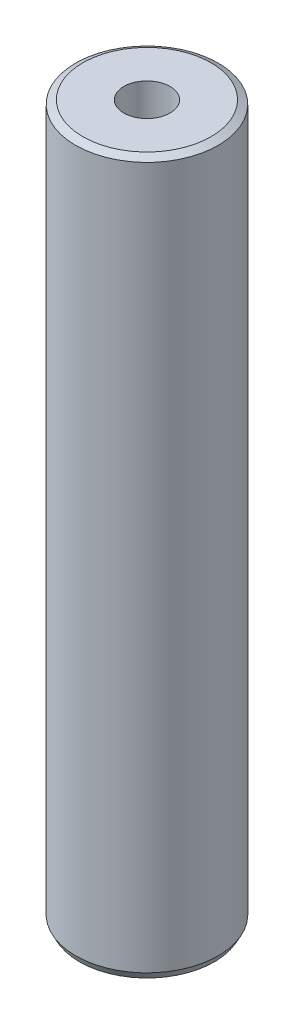
ISO-10303-21;
HEADER;
FILE_DESCRIPTION(('STEP AP214'),'2;1');
FILE_NAME('part.step','',(''),(''),'','','');
FILE_SCHEMA(('AUTOMOTIVE_DESIGN { 1 0 10303 214 1 1 1 1 }'));
ENDSEC;
DATA;
#1=APPLICATION_CONTEXT('core data for automotive mechanical design processes');
#2=APPLICATION_PROTOCOL_DEFINITION('international standard','automotive_design',2000,#1);
#3=PRODUCT_CONTEXT('',#1,'mechanical');
#4=PRODUCT('Part','Part','',(#3));
#5=PRODUCT_RELATED_PRODUCT_CATEGORY('part','',(#4));
#6=PRODUCT_DEFINITION_FORMATION('','',#4);
#7=PRODUCT_DEFINITION_CONTEXT('part definition',#1,'design');
#8=PRODUCT_DEFINITION('design','',#6,#7);
#9=PRODUCT_DEFINITION_SHAPE('','',#8);
#10=(LENGTH_UNIT() NAMED_UNIT(*) SI_UNIT(.MILLI.,.METRE.));
#11=(NAMED_UNIT(*) PLANE_ANGLE_UNIT() SI_UNIT($,.RADIAN.));
#12=(NAMED_UNIT(*) SI_UNIT($,.STERADIAN.) SOLID_ANGLE_UNIT());
#13=UNCERTAINTY_MEASURE_WITH_UNIT(LENGTH_MEASURE(1.E-05),#10,'distance_accuracy_value','');
#14=(GEOMETRIC_REPRESENTATION_CONTEXT(3) GLOBAL_UNCERTAINTY_ASSIGNED_CONTEXT((#13)) GLOBAL_UNIT_ASSIGNED_CONTEXT((#10,
#11,#12)) REPRESENTATION_CONTEXT('',''));
#15=CARTESIAN_POINT('',(0.,0.,0.));
#16=DIRECTION('',(0.,0.,1.));
#17=DIRECTION('',(1.,0.,0.));
#18=AXIS2_PLACEMENT_3D('',#15,#16,#17);
#19=CARTESIAN_POINT('',(0.,600.,0.));
#20=DIRECTION('',(0.,-1.,0.));
#21=DIRECTION('',(0.,0.,-1.));
#22=AXIS2_PLACEMENT_3D('',#19,#20,#21);
#23=CYLINDRICAL_SURFACE('',#22,60.);
#24=CARTESIAN_POINT('',(0.,596.731679178508,0.));
#25=DIRECTION('',(0.,1.,0.));
#26=DIRECTION('',(0.,0.,1.));
#27=AXIS2_PLACEMENT_3D('',#24,#25,#26);
#28=CIRCLE('',#27,60.);
#29=CARTESIAN_POINT('',(0.,596.731679178508,60.));
#30=VERTEX_POINT('',#29);
#31=EDGE_CURVE('E50',#30,#30,#28,.F.);
#32=ORIENTED_EDGE('',*,*,#31,.T.);
#33=EDGE_LOOP('',(#32));
#34=FACE_BOUND('',#33,.T.);
#35=CARTESIAN_POINT('',(0.,6.07572762020392,0.));
#36=DIRECTION('',(0.,1.,0.));
#37=DIRECTION('',(0.,0.,1.));
#38=AXIS2_PLACEMENT_3D('',#35,#36,#37);
#39=CIRCLE('',#38,60.);
#40=CARTESIAN_POINT('',(0.,6.07572762020392,60.));
#41=VERTEX_POINT('',#40);
#42=EDGE_CURVE('E51',#41,#41,#39,.T.);
#43=ORIENTED_EDGE('',*,*,#42,.T.);
#44=EDGE_LOOP('',(#43));
#45=FACE_BOUND('',#44,.T.);
#46=ADVANCED_FACE('F39',(#34,#45),#23,.T.);
#47=CARTESIAN_POINT('',(0.,600.,0.));
#48=DIRECTION('',(0.,1.,0.));
#49=DIRECTION('',(0.,0.,1.));
#50=AXIS2_PLACEMENT_3D('',#47,#48,#49);
#51=PLANE('',#50);
#52=CARTESIAN_POINT('',(0.,600.,0.));
#53=DIRECTION('',(0.,1.,0.));
#54=DIRECTION('',(0.,0.,1.));
#55=AXIS2_PLACEMENT_3D('',#52,#53,#54);
#56=CIRCLE('',#55,53.9242723797959);
#57=CARTESIAN_POINT('',(0.,600.,53.9242723797959));
#58=VERTEX_POINT('',#57);
#59=EDGE_CURVE('E54',#58,#58,#56,.T.);
#60=ORIENTED_EDGE('',*,*,#59,.T.);
#61=EDGE_LOOP('',(#60));
#62=FACE_BOUND('',#61,.T.);
#63=CARTESIAN_POINT('',(0.,600.,0.));
#64=DIRECTION('',(0.,1.,0.));
#65=DIRECTION('',(0.,0.,1.));
#66=AXIS2_PLACEMENT_3D('',#63,#64,#65);
#67=CIRCLE('',#66,19.4288408507613);
#68=CARTESIAN_POINT('',(0.,600.,19.4288408507613));
#69=VERTEX_POINT('',#68);
#70=EDGE_CURVE('E58',#69,#69,#67,.T.);
#71=ORIENTED_EDGE('',*,*,#70,.F.);
#72=EDGE_LOOP('',(#71));
#73=FACE_BOUND('',#72,.T.);
#74=ADVANCED_FACE('F69',(#62,#73),#51,.T.);
#75=CARTESIAN_POINT('',(0.,0.,0.));
#76=DIRECTION('',(0.,1.,0.));
#77=DIRECTION('',(0.,0.,1.));
#78=AXIS2_PLACEMENT_3D('',#75,#76,#77);
#79=PLANE('',#78);
#80=CARTESIAN_POINT('',(0.,0.,0.));
#81=DIRECTION('',(0.,1.,0.));
#82=DIRECTION('',(0.,0.,1.));
#83=AXIS2_PLACEMENT_3D('',#80,#81,#82);
#84=CIRCLE('',#83,56.7316791785077);
#85=CARTESIAN_POINT('',(0.,0.,56.7316791785077));
#86=VERTEX_POINT('',#85);
#87=EDGE_CURVE('E10',#86,#86,#84,.F.);
#88=ORIENTED_EDGE('',*,*,#87,.T.);
#89=EDGE_LOOP('',(#88));
#90=FACE_BOUND('',#89,.T.);
#91=CARTESIAN_POINT('',(0.,0.,0.));
#92=DIRECTION('',(0.,1.,0.));
#93=DIRECTION('',(0.,0.,1.));
#94=AXIS2_PLACEMENT_3D('',#91,#92,#93);
#95=CIRCLE('',#94,19.4288408507613);
#96=CARTESIAN_POINT('',(0.,0.,19.4288408507613));
#97=VERTEX_POINT('',#96);
#98=EDGE_CURVE('E63',#97,#97,#95,.T.);
#99=ORIENTED_EDGE('',*,*,#98,.T.);
#100=EDGE_LOOP('',(#99));
#101=FACE_BOUND('',#100,.T.);
#102=ADVANCED_FACE('F75',(#90,#101),#79,.F.);
#103=CARTESIAN_POINT('',(0.,600.,0.));
#104=DIRECTION('',(0.,-1.,0.));
#105=DIRECTION('',(0.,0.,-1.));
#106=AXIS2_PLACEMENT_3D('',#103,#104,#105);
#107=CYLINDRICAL_SURFACE('',#106,19.4288408507613);
#108=ORIENTED_EDGE('',*,*,#70,.T.);
#109=EDGE_LOOP('',(#108));
#110=FACE_BOUND('',#109,.T.);
#111=ORIENTED_EDGE('',*,*,#98,.F.);
#112=EDGE_LOOP('',(#111));
#113=FACE_BOUND('',#112,.T.);
#114=ADVANCED_FACE('F70',(#110,#113),#107,.F.);
#115=CARTESIAN_POINT('',(0.,600.,0.));
#116=DIRECTION('',(0.,-1.,0.));
#117=DIRECTION('',(0.,0.,-1.));
#118=AXIS2_PLACEMENT_3D('',#115,#116,#117);
#119=CONICAL_SURFACE('',#118,53.9242723797959,1.07726651831578);
#120=ORIENTED_EDGE('',*,*,#31,.F.);
#121=EDGE_LOOP('',(#120));
#122=FACE_BOUND('',#121,.T.);
#123=ORIENTED_EDGE('',*,*,#59,.F.);
#124=EDGE_LOOP('',(#123));
#125=FACE_BOUND('',#124,.T.);
#126=ADVANCED_FACE('F81',(#122,#125),#119,.T.);
#127=CARTESIAN_POINT('',(0.,6.07572762020392,0.));
#128=DIRECTION('',(0.,1.,0.));
#129=DIRECTION('',(0.,0.,1.));
#130=AXIS2_PLACEMENT_3D('',#127,#128,#129);
#131=CONICAL_SURFACE('',#130,60.,0.493529808479111);
#132=CARTESIAN_POINT('',(0.,0.,56.7316791785077));
#133=CARTESIAN_POINT('',(0.,0.0632888293771232,56.7657241870649));
#134=CARTESIAN_POINT('',(0.,0.126577658754247,56.7997691956221));
#135=CARTESIAN_POINT('',(0.,0.253155317508496,56.8678592127365));
#136=CARTESIAN_POINT('',(0.,0.31644414688562,56.9019042212937));
#137=CARTESIAN_POINT('',(0.,0.443021805639868,56.9699942384082));
#138=CARTESIAN_POINT('',(0.,0.506310635016992,57.0040392469654));
#139=CARTESIAN_POINT('',(0.,0.632888293771241,57.0721292640798));
#140=CARTESIAN_POINT('',(0.,0.696177123148365,57.106174272637));
#141=CARTESIAN_POINT('',(0.,0.822754781902613,57.1742642897514));
#142=CARTESIAN_POINT('',(0.,0.886043611279737,57.2083092983086));
#143=CARTESIAN_POINT('',(0.,1.01262127003399,57.2763993154231));
#144=CARTESIAN_POINT('',(0.,1.07591009941111,57.3104443239803));
#145=CARTESIAN_POINT('',(0.,1.20248775816536,57.3785343410947));
#146=CARTESIAN_POINT('',(0.,1.26577658754248,57.4125793496519));
#147=CARTESIAN_POINT('',(0.,1.39235424629673,57.4806693667663));
#148=CARTESIAN_POINT('',(0.,1.45564307567385,57.5147143753235));
#149=CARTESIAN_POINT('',(0.,1.5822207344281,57.582804392438));
#150=CARTESIAN_POINT('',(0.,1.64550956380523,57.6168494009952));
#151=CARTESIAN_POINT('',(0.,1.77208722255948,57.6849394181096));
#152=CARTESIAN_POINT('',(0.,1.8353760519366,57.7189844266668));
#153=CARTESIAN_POINT('',(0.,1.96195371069085,57.7870744437812));
#154=CARTESIAN_POINT('',(0.,2.02524254006797,57.8211194523385));
#155=CARTESIAN_POINT('',(0.,2.15182019882222,57.8892094694529));
#156=CARTESIAN_POINT('',(0.,2.21510902819935,57.9232544780101));
#157=CARTESIAN_POINT('',(0.,2.34168668695359,57.9913444951245));
#158=CARTESIAN_POINT('',(0.,2.40497551633072,58.0253895036817));
#159=CARTESIAN_POINT('',(0.,2.53155317508497,58.0934795207961));
#160=CARTESIAN_POINT('',(0.,2.59484200446209,58.1275245293534));
#161=CARTESIAN_POINT('',(0.,2.72141966321634,58.1956145464678));
#162=CARTESIAN_POINT('',(0.,2.78470849259346,58.229659555025));
#163=CARTESIAN_POINT('',(0.,2.91128615134771,58.2977495721394));
#164=CARTESIAN_POINT('',(0.,2.97457498072483,58.3317945806966));
#165=CARTESIAN_POINT('',(0.,3.10115263947908,58.3998845978111));
#166=CARTESIAN_POINT('',(0.,3.16444146885621,58.4339296063683));
#167=CARTESIAN_POINT('',(0.,3.29101912761046,58.5020196234827));
#168=CARTESIAN_POINT('',(0.,3.35430795698758,58.5360646320399));
#169=CARTESIAN_POINT('',(0.,3.48088561574183,58.6041546491543));
#170=CARTESIAN_POINT('',(0.,3.54417444511895,58.6381996577115));
#171=CARTESIAN_POINT('',(0.,3.6707521038732,58.706289674826));
#172=CARTESIAN_POINT('',(0.,3.73404093325032,58.7403346833832));
#173=CARTESIAN_POINT('',(0.,3.86061859200457,58.8084247004976));
#174=CARTESIAN_POINT('',(0.,3.9239074213817,58.8424697090548));
#175=CARTESIAN_POINT('',(0.,4.05048508013595,58.9105597261692));
#176=CARTESIAN_POINT('',(0.,4.11377390951307,58.9446047347264));
#177=CARTESIAN_POINT('',(0.,4.24035156826732,59.0126947518409));
#178=CARTESIAN_POINT('',(0.,4.30364039764444,59.0467397603981));
#179=CARTESIAN_POINT('',(0.,4.43021805639869,59.1148297775125));
#180=CARTESIAN_POINT('',(0.,4.49350688577582,59.1488747860697));
#181=CARTESIAN_POINT('',(0.,4.62008454453006,59.2169648031841));
#182=CARTESIAN_POINT('',(0.,4.68337337390719,59.2510098117413));
#183=CARTESIAN_POINT('',(0.,4.80995103266144,59.3190998288558));
#184=CARTESIAN_POINT('',(0.,4.87323986203856,59.353144837413));
#185=CARTESIAN_POINT('',(0.,4.99981752079281,59.4212348545274));
#186=CARTESIAN_POINT('',(0.,5.06310635016993,59.4552798630846));
#187=CARTESIAN_POINT('',(0.,5.18968400892418,59.523369880199));
#188=CARTESIAN_POINT('',(0.,5.2529728383013,59.5574148887562));
#189=CARTESIAN_POINT('',(0.,5.37955049705555,59.6255049058707));
#190=CARTESIAN_POINT('',(0.,5.44283932643268,59.6595499144279));
#191=CARTESIAN_POINT('',(0.,5.56941698518693,59.7276399315423));
#192=CARTESIAN_POINT('',(0.,5.63270581456405,59.7616849400995));
#193=CARTESIAN_POINT('',(0.,5.7592834733183,59.8297749572139));
#194=CARTESIAN_POINT('',(0.,5.82257230269542,59.8638199657711));
#195=CARTESIAN_POINT('',(0.,5.94914996144967,59.9319099828856));
#196=CARTESIAN_POINT('',(0.,6.01243879082679,59.9659549914428));
#197=CARTESIAN_POINT('',(0.,6.07572762020392,60.));
#198=B_SPLINE_CURVE_WITH_KNOTS('',3,(#132,#133,#134,#135,#136,#137,#138,#139,#140,#141,#142,
#143,#144,#145,#146,#147,#148,#149,#150,#151,#152,#153,#154,#155,#156,#157,#158,#159,#160,#161,
#162,#163,#164,#165,#166,#167,#168,#169,#170,#171,#172,#173,#174,#175,#176,#177,#178,#179,#180,
#181,#182,#183,#184,#185,#186,#187,#188,#189,#190,#191,#192,#193,#194,#195,#196,#197),
.UNSPECIFIED.,.F.,.F.,(4,2,2,2,2,2,2,2,2,2,2,2,2,2,2,2,2,2,2,2,2,2,2,2,2,2,2,2,2,2,2,2,4),(0.,
0.215594171498874,0.431188342997749,0.646782514496623,0.862376685995498,1.07797085749437,
1.29356502899325,1.50915920049212,1.724753371991,1.94034754348987,2.15594171498874,
2.37153588648762,2.58713005798649,2.80272422948537,3.01831840098424,3.23391257248312,
3.44950674398199,3.66510091548087,3.88069508697974,4.09628925847862,4.31188342997749,
4.52747760147637,4.74307177297524,4.95866594447412,5.17426011597299,5.38985428747187,
5.60544845897074,5.82104263046962,6.03663680196849,6.25223097346736,6.46782514496624,
6.68341931646511,6.89901348796399),.UNSPECIFIED.);
#199=EDGE_CURVE('BSEAM45',#86,#41,#198,.T.);
#200=ORIENTED_EDGE('',*,*,#87,.F.);
#201=ORIENTED_EDGE('',*,*,#42,.F.);
#202=ORIENTED_EDGE('',*,*,#199,.T.);
#203=ORIENTED_EDGE('',*,*,#199,.F.);
#204=EDGE_LOOP('',(#200,#202,#201,#203));
#205=FACE_BOUND('',#204,.T.);
#206=ADVANCED_FACE('F45',(#205),#131,.T.);
#207=CLOSED_SHELL('',(#46,#74,#102,#114,#126,#206));
#208=MANIFOLD_SOLID_BREP('B2',#207);
#209=ADVANCED_BREP_SHAPE_REPRESENTATION('',(#18,#208),#14);
#210=SHAPE_DEFINITION_REPRESENTATION(#9,#209);
ENDSEC;
END-ISO-10303-21;
